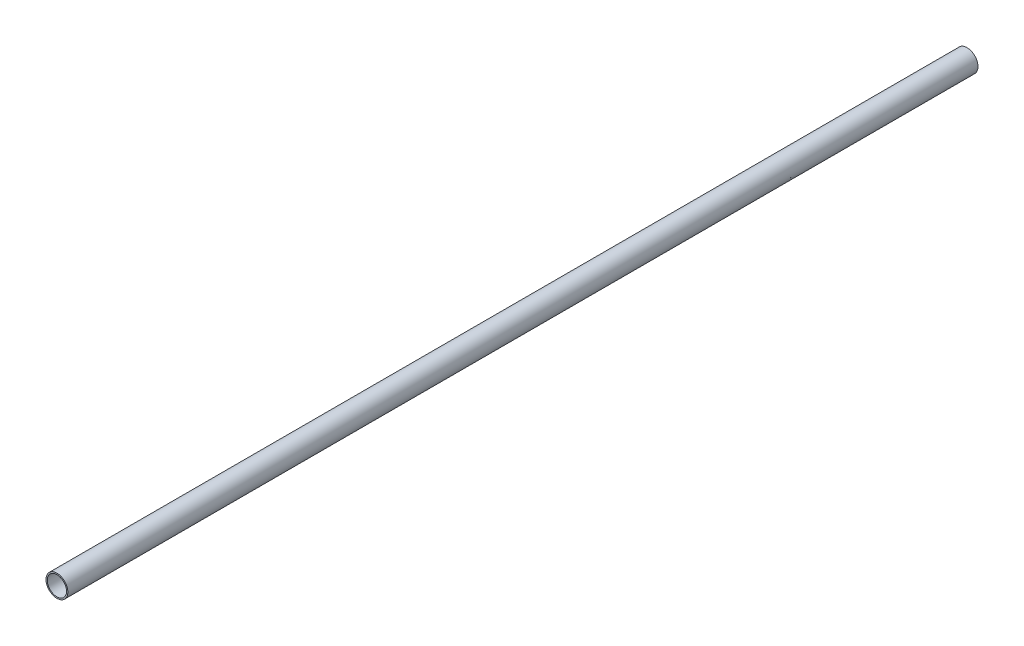
ISO-10303-21;
HEADER;
FILE_DESCRIPTION(('STEP AP214'),'2;1');
FILE_NAME('part.step','',(''),(''),'','','');
FILE_SCHEMA(('AUTOMOTIVE_DESIGN { 1 0 10303 214 1 1 1 1 }'));
ENDSEC;
DATA;
#1=APPLICATION_CONTEXT('core data for automotive mechanical design processes');
#2=APPLICATION_PROTOCOL_DEFINITION('international standard','automotive_design',2000,#1);
#3=PRODUCT_CONTEXT('',#1,'mechanical');
#4=PRODUCT('Part','Part','',(#3));
#5=PRODUCT_RELATED_PRODUCT_CATEGORY('part','',(#4));
#6=PRODUCT_DEFINITION_FORMATION('','',#4);
#7=PRODUCT_DEFINITION_CONTEXT('part definition',#1,'design');
#8=PRODUCT_DEFINITION('design','',#6,#7);
#9=PRODUCT_DEFINITION_SHAPE('','',#8);
#10=(LENGTH_UNIT() NAMED_UNIT(*) SI_UNIT(.MILLI.,.METRE.));
#11=(NAMED_UNIT(*) PLANE_ANGLE_UNIT() SI_UNIT($,.RADIAN.));
#12=(NAMED_UNIT(*) SI_UNIT($,.STERADIAN.) SOLID_ANGLE_UNIT());
#13=UNCERTAINTY_MEASURE_WITH_UNIT(LENGTH_MEASURE(1.E-05),#10,'distance_accuracy_value','');
#14=(GEOMETRIC_REPRESENTATION_CONTEXT(3) GLOBAL_UNCERTAINTY_ASSIGNED_CONTEXT((#13)) GLOBAL_UNIT_ASSIGNED_CONTEXT((#10,
#11,#12)) REPRESENTATION_CONTEXT('',''));
#15=CARTESIAN_POINT('',(0.,0.,0.));
#16=DIRECTION('',(0.,0.,1.));
#17=DIRECTION('',(1.,0.,0.));
#18=AXIS2_PLACEMENT_3D('',#15,#16,#17);
#19=CARTESIAN_POINT('',(0.,719.,-3240.));
#20=DIRECTION('',(0.,0.,1.));
#21=DIRECTION('',(1.,0.,0.));
#22=AXIS2_PLACEMENT_3D('',#19,#20,#21);
#23=CYLINDRICAL_SURFACE('',#22,12.5);
#24=CARTESIAN_POINT('',(0.,719.,-1060.));
#25=DIRECTION('',(0.,0.,-1.));
#26=DIRECTION('',(-1.,0.,0.));
#27=AXIS2_PLACEMENT_3D('',#24,#25,#26);
#28=CIRCLE('',#27,12.5);
#29=CARTESIAN_POINT('',(-12.5,719.,-1060.));
#30=VERTEX_POINT('',#29);
#31=EDGE_CURVE('E51',#30,#30,#28,.T.);
#32=ORIENTED_EDGE('',*,*,#31,.F.);
#33=EDGE_LOOP('',(#32));
#34=FACE_BOUND('',#33,.T.);
#35=CARTESIAN_POINT('',(0.,719.,-19.9999999999996));
#36=DIRECTION('',(0.,0.,1.));
#37=DIRECTION('',(1.,0.,0.));
#38=AXIS2_PLACEMENT_3D('',#35,#36,#37);
#39=CIRCLE('',#38,12.5);
#40=CARTESIAN_POINT('',(12.5,719.,-19.9999999999996));
#41=VERTEX_POINT('',#40);
#42=EDGE_CURVE('E41',#41,#41,#39,.T.);
#43=ORIENTED_EDGE('',*,*,#42,.F.);
#44=EDGE_LOOP('',(#43));
#45=FACE_BOUND('',#44,.T.);
#46=ADVANCED_FACE('F37',(#34,#45),#23,.T.);
#47=CARTESIAN_POINT('',(-15.5,0.,-1060.));
#48=DIRECTION('',(0.,0.,-1.));
#49=DIRECTION('',(-1.,0.,0.));
#50=AXIS2_PLACEMENT_3D('',#47,#48,#49);
#51=PLANE('',#50);
#52=CARTESIAN_POINT('',(0.,719.,-1060.));
#53=DIRECTION('',(0.,0.,-1.));
#54=DIRECTION('',(-1.,0.,0.));
#55=AXIS2_PLACEMENT_3D('',#52,#53,#54);
#56=CIRCLE('',#55,11.);
#57=CARTESIAN_POINT('',(-11.,719.,-1060.));
#58=VERTEX_POINT('',#57);
#59=EDGE_CURVE('E49',#58,#58,#56,.T.);
#60=ORIENTED_EDGE('',*,*,#59,.F.);
#61=EDGE_LOOP('',(#60));
#62=FACE_BOUND('',#61,.T.);
#63=ORIENTED_EDGE('',*,*,#31,.T.);
#64=EDGE_LOOP('',(#63));
#65=FACE_BOUND('',#64,.T.);
#66=ADVANCED_FACE('F59',(#62,#65),#51,.T.);
#67=CARTESIAN_POINT('',(-15.5,-2.22044604925031E-13,-19.9999999999998));
#68=DIRECTION('',(0.,0.,1.));
#69=DIRECTION('',(1.,0.,0.));
#70=AXIS2_PLACEMENT_3D('',#67,#68,#69);
#71=PLANE('',#70);
#72=CARTESIAN_POINT('',(0.,719.,-19.9999999999996));
#73=DIRECTION('',(0.,0.,1.));
#74=DIRECTION('',(1.,0.,0.));
#75=AXIS2_PLACEMENT_3D('',#72,#73,#74);
#76=CIRCLE('',#75,11.);
#77=CARTESIAN_POINT('',(11.,719.,-19.9999999999996));
#78=VERTEX_POINT('',#77);
#79=EDGE_CURVE('E10',#78,#78,#76,.T.);
#80=ORIENTED_EDGE('',*,*,#79,.F.);
#81=EDGE_LOOP('',(#80));
#82=FACE_BOUND('',#81,.T.);
#83=ORIENTED_EDGE('',*,*,#42,.T.);
#84=EDGE_LOOP('',(#83));
#85=FACE_BOUND('',#84,.T.);
#86=ADVANCED_FACE('F61',(#82,#85),#71,.T.);
#87=CARTESIAN_POINT('',(0.,719.,-3240.));
#88=DIRECTION('',(0.,0.,1.));
#89=DIRECTION('',(1.,0.,0.));
#90=AXIS2_PLACEMENT_3D('',#87,#88,#89);
#91=CYLINDRICAL_SURFACE('',#90,11.);
#92=ORIENTED_EDGE('',*,*,#59,.T.);
#93=EDGE_LOOP('',(#92));
#94=FACE_BOUND('',#93,.T.);
#95=ORIENTED_EDGE('',*,*,#79,.T.);
#96=EDGE_LOOP('',(#95));
#97=FACE_BOUND('',#96,.T.);
#98=ADVANCED_FACE('F39',(#94,#97),#91,.F.);
#99=CLOSED_SHELL('',(#46,#66,#86,#98));
#100=MANIFOLD_SOLID_BREP('B2',#99);
#101=ADVANCED_BREP_SHAPE_REPRESENTATION('',(#18,#100),#14);
#102=SHAPE_DEFINITION_REPRESENTATION(#9,#101);
ENDSEC;
END-ISO-10303-21;
